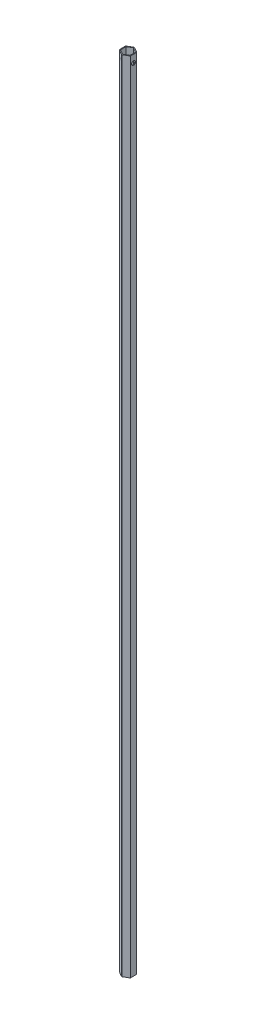
ISO-10303-21;
HEADER;
FILE_DESCRIPTION(('STEP AP214'),'2;1');
FILE_NAME('part.step','',(''),(''),'','','');
FILE_SCHEMA(('AUTOMOTIVE_DESIGN { 1 0 10303 214 1 1 1 1 }'));
ENDSEC;
DATA;
#1=APPLICATION_CONTEXT('core data for automotive mechanical design processes');
#2=APPLICATION_PROTOCOL_DEFINITION('international standard','automotive_design',2000,#1);
#3=PRODUCT_CONTEXT('',#1,'mechanical');
#4=PRODUCT('Part','Part','',(#3));
#5=PRODUCT_RELATED_PRODUCT_CATEGORY('part','',(#4));
#6=PRODUCT_DEFINITION_FORMATION('','',#4);
#7=PRODUCT_DEFINITION_CONTEXT('part definition',#1,'design');
#8=PRODUCT_DEFINITION('design','',#6,#7);
#9=PRODUCT_DEFINITION_SHAPE('','',#8);
#10=(LENGTH_UNIT() NAMED_UNIT(*) SI_UNIT(.MILLI.,.METRE.));
#11=(NAMED_UNIT(*) PLANE_ANGLE_UNIT() SI_UNIT($,.RADIAN.));
#12=(NAMED_UNIT(*) SI_UNIT($,.STERADIAN.) SOLID_ANGLE_UNIT());
#13=UNCERTAINTY_MEASURE_WITH_UNIT(LENGTH_MEASURE(1.E-05),#10,'distance_accuracy_value','');
#14=(GEOMETRIC_REPRESENTATION_CONTEXT(3) GLOBAL_UNCERTAINTY_ASSIGNED_CONTEXT((#13)) GLOBAL_UNIT_ASSIGNED_CONTEXT((#10,
#11,#12)) REPRESENTATION_CONTEXT('',''));
#15=CARTESIAN_POINT('',(0.,0.,0.));
#16=DIRECTION('',(0.,0.,1.));
#17=DIRECTION('',(1.,0.,0.));
#18=AXIS2_PLACEMENT_3D('',#15,#16,#17);
#19=CARTESIAN_POINT('',(9.1894241550849,1322.07,-5.34713867701928));
#20=DIRECTION('',(-0.497060999227279,0.,0.867715600324887));
#21=DIRECTION('',(0.867715600324887,0.,0.497060999227279));
#22=AXIS2_PLACEMENT_3D('',#19,#20,#21);
#23=PLANE('',#22);
#24=DIRECTION('',(0.867715600324887,0.,0.497060999227279));
#25=VECTOR('',#24,1.);
#26=CARTESIAN_POINT('',(9.1894241550849,238.76,-5.34713867701928));
#27=LINE('',#26,#25);
#28=CARTESIAN_POINT('',(0.600193456678505,238.76,-10.2673816597949));
#29=VERTEX_POINT('',#28);
#30=CARTESIAN_POINT('',(8.55318484409183,238.76,-5.71160112018785));
#31=VERTEX_POINT('',#30);
#32=EDGE_CURVE('E11',#29,#31,#27,.T.);
#33=ORIENTED_EDGE('',*,*,#32,.F.);
#34=DIRECTION('',(0.,-1.,0.));
#35=VECTOR('',#34,1.);
#36=CARTESIAN_POINT('',(0.600193456678505,1322.07,-10.2673816597949));
#37=LINE('',#36,#35);
#38=CARTESIAN_POINT('',(0.600193456678505,247.925435523385,-10.2673816597949));
#39=VERTEX_POINT('',#38);
#40=EDGE_CURVE('E192',#29,#39,#37,.F.);
#41=ORIENTED_EDGE('',*,*,#40,.T.);
#42=DIRECTION('',(-0.867715600324887,0.,-0.497060999227279));
#43=VECTOR('',#42,1.);
#44=CARTESIAN_POINT('',(9.1894241550849,247.925435523385,-5.34713867701928));
#45=LINE('',#44,#43);
#46=CARTESIAN_POINT('',(8.55318484409183,247.925435523385,-5.71160112018785));
#47=VERTEX_POINT('',#46);
#48=EDGE_CURVE('E52',#47,#39,#45,.T.);
#49=ORIENTED_EDGE('',*,*,#48,.F.);
#50=DIRECTION('',(0.,-1.,0.));
#51=VECTOR('',#50,1.);
#52=CARTESIAN_POINT('',(8.55318484409183,1322.07,-5.71160112018785));
#53=LINE('',#52,#51);
#54=EDGE_CURVE('E304',#47,#31,#53,.T.);
#55=ORIENTED_EDGE('',*,*,#54,.T.);
#56=EDGE_LOOP('',(#33,#41,#49,#55));
#57=FACE_BOUND('',#56,.T.);
#58=ADVANCED_FACE('F43',(#57),#23,.F.);
#59=CARTESIAN_POINT('',(0.600193456678505,-2.54,-10.2673816597949));
#60=VERTEX_POINT('',#59);
#61=EDGE_CURVE('E185',#60,#29,#37,.F.);
#62=ORIENTED_EDGE('',*,*,#61,.T.);
#63=ORIENTED_EDGE('',*,*,#32,.T.);
#64=CARTESIAN_POINT('',(8.55318484409183,-2.54,-5.71160112018785));
#65=VERTEX_POINT('',#64);
#66=EDGE_CURVE('E194',#31,#65,#53,.T.);
#67=ORIENTED_EDGE('',*,*,#66,.T.);
#68=DIRECTION('',(0.867715600324887,0.,0.497060999227279));
#69=VECTOR('',#68,1.);
#70=CARTESIAN_POINT('',(0.600193456678505,-2.54,-10.2673816597949));
#71=LINE('',#70,#69);
#72=EDGE_CURVE('E198',#60,#65,#71,.T.);
#73=ORIENTED_EDGE('',*,*,#72,.F.);
#74=EDGE_LOOP('',(#62,#63,#67,#73));
#75=FACE_BOUND('',#74,.T.);
#76=ADVANCED_FACE('F199',(#75),#23,.F.);
#77=CARTESIAN_POINT('',(-9.1894241550849,1322.07,5.34713867701928));
#78=DIRECTION('',(0.497060999227279,0.,-0.867715600324887));
#79=DIRECTION('',(-0.867715600324887,0.,-0.497060999227279));
#80=AXIS2_PLACEMENT_3D('',#77,#78,#79);
#81=PLANE('',#80);
#82=DIRECTION('',(0.867715600324887,0.,0.497060999227279));
#83=VECTOR('',#82,1.);
#84=CARTESIAN_POINT('',(-9.1894241550849,1312.90456447661,5.34713867701928));
#85=LINE('',#84,#83);
#86=CARTESIAN_POINT('',(-8.55318484409183,1312.90456447661,5.71160112018785));
#87=VERTEX_POINT('',#86);
#88=CARTESIAN_POINT('',(-0.600193456678505,1312.90456447661,10.2673816597949));
#89=VERTEX_POINT('',#88);
#90=EDGE_CURVE('E344',#87,#89,#85,.T.);
#91=ORIENTED_EDGE('',*,*,#90,.F.);
#92=DIRECTION('',(0.,-1.,0.));
#93=VECTOR('',#92,1.);
#94=CARTESIAN_POINT('',(-8.55318484409183,1322.07,5.71160112018785));
#95=LINE('',#94,#93);
#96=CARTESIAN_POINT('',(-8.55318484409183,-2.54,5.71160112018785));
#97=VERTEX_POINT('',#96);
#98=EDGE_CURVE('E328',#87,#97,#95,.T.);
#99=ORIENTED_EDGE('',*,*,#98,.T.);
#100=DIRECTION('',(-0.867715600324887,0.,-0.497060999227279));
#101=VECTOR('',#100,1.);
#102=CARTESIAN_POINT('',(-0.600193456678502,-2.54,10.2673816597949));
#103=LINE('',#102,#101);
#104=CARTESIAN_POINT('',(-0.600193456678502,-2.54,10.2673816597949));
#105=VERTEX_POINT('',#104);
#106=EDGE_CURVE('E228',#105,#97,#103,.T.);
#107=ORIENTED_EDGE('',*,*,#106,.F.);
#108=DIRECTION('',(0.,-1.,0.));
#109=VECTOR('',#108,1.);
#110=CARTESIAN_POINT('',(-0.600193456678505,1322.07,10.2673816597949));
#111=LINE('',#110,#109);
#112=EDGE_CURVE('E325',#105,#89,#111,.F.);
#113=ORIENTED_EDGE('',*,*,#112,.T.);
#114=EDGE_LOOP('',(#91,#99,#107,#113));
#115=FACE_BOUND('',#114,.T.);
#116=ADVANCED_FACE('F366',(#115),#81,.F.);
#117=CARTESIAN_POINT('',(0.,1322.07,0.));
#118=DIRECTION('',(0.,1.,0.));
#119=DIRECTION('',(0.,0.,1.));
#120=AXIS2_PLACEMENT_3D('',#117,#118,#119);
#121=PLANE('',#120);
#122=DIRECTION('',(-0.00339034760114294,0.,-0.999994252755056));
#123=VECTOR('',#122,1.);
#124=CARTESIAN_POINT('',(9.22547000939946,1322.07,5.28470542594423));
#125=LINE('',#124,#123);
#126=CARTESIAN_POINT('',(9.22547000939946,1322.07,5.28470542594423));
#127=VERTEX_POINT('',#126);
#128=CARTESIAN_POINT('',(9.19191007607211,1322.07,-4.6139080492287));
#129=VERTEX_POINT('',#128);
#130=EDGE_CURVE('E293',#127,#129,#125,.T.);
#131=ORIENTED_EDGE('',*,*,#130,.T.);
#132=CARTESIAN_POINT('',(7.92191737507319,1322.07,-4.60960230777524));
#133=DIRECTION('',(0.,1.,0.));
#134=DIRECTION('',(0.,0.,1.));
#135=AXIS2_PLACEMENT_3D('',#132,#133,#134);
#136=CIRCLE('',#135,1.27);
#137=CARTESIAN_POINT('',(8.55318484409183,1322.07,-5.71160112018785));
#138=VERTEX_POINT('',#137);
#139=EDGE_CURVE('E314',#129,#138,#136,.T.);
#140=ORIENTED_EDGE('',*,*,#139,.T.);
#141=DIRECTION('',(-0.867715600324887,0.,-0.497060999227279));
#142=VECTOR('',#141,1.);
#143=CARTESIAN_POINT('',(9.1894241550849,1322.07,-5.34713867701928));
#144=LINE('',#143,#142);
#145=CARTESIAN_POINT('',(0.600193456678505,1322.07,-10.2673816597949));
#146=VERTEX_POINT('',#145);
#147=EDGE_CURVE('E296',#138,#146,#144,.T.);
#148=ORIENTED_EDGE('',*,*,#147,.T.);
#149=CARTESIAN_POINT('',(-0.0310740123401385,1322.07,-9.16538284738234));
#150=DIRECTION('',(0.,1.,0.));
#151=DIRECTION('',(0.,0.,1.));
#152=AXIS2_PLACEMENT_3D('',#149,#150,#151);
#153=CIRCLE('',#152,1.27);
#154=CARTESIAN_POINT('',(-0.669799244320415,1322.07,-10.2630759183415));
#155=VERTEX_POINT('',#154);
#156=EDGE_CURVE('E312',#146,#155,#153,.T.);
#157=ORIENTED_EDGE('',*,*,#156,.T.);
#158=DIRECTION('',(-0.864325252723744,0.,0.502933253527778));
#159=VECTOR('',#158,1.);
#160=CARTESIAN_POINT('',(-0.0360458543145602,1322.07,-10.6318441029635));
#161=LINE('',#160,#159);
#162=CARTESIAN_POINT('',(-8.5917166193936,1322.07,-5.65347361056625));
#163=VERTEX_POINT('',#162);
#164=EDGE_CURVE('E282',#155,#163,#161,.T.);
#165=ORIENTED_EDGE('',*,*,#164,.T.);
#166=CARTESIAN_POINT('',(-7.95299138741333,1322.07,-4.55578053960709));
#167=DIRECTION('',(0.,1.,0.));
#168=DIRECTION('',(0.,0.,1.));
#169=AXIS2_PLACEMENT_3D('',#166,#167,#168);
#170=CIRCLE('',#169,1.27);
#171=CARTESIAN_POINT('',(-9.22298408841225,1322.07,-4.55147479815364));
#172=VERTEX_POINT('',#171);
#173=EDGE_CURVE('E310',#163,#172,#170,.T.);
#174=ORIENTED_EDGE('',*,*,#173,.T.);
#175=DIRECTION('',(0.0033903476011431,0.,0.999994252755056));
#176=VECTOR('',#175,1.);
#177=CARTESIAN_POINT('',(-9.22547000939946,1322.07,-5.28470542594423));
#178=LINE('',#177,#176);
#179=CARTESIAN_POINT('',(-9.19191007607211,1322.07,4.6139080492287));
#180=VERTEX_POINT('',#179);
#181=EDGE_CURVE('E285',#172,#180,#178,.T.);
#182=ORIENTED_EDGE('',*,*,#181,.T.);
#183=CARTESIAN_POINT('',(-7.92191737507319,1322.07,4.60960230777524));
#184=DIRECTION('',(0.,1.,0.));
#185=DIRECTION('',(0.,0.,1.));
#186=AXIS2_PLACEMENT_3D('',#183,#184,#185);
#187=CIRCLE('',#186,1.27);
#188=CARTESIAN_POINT('',(-8.55318484409183,1322.07,5.71160112018785));
#189=VERTEX_POINT('',#188);
#190=EDGE_CURVE('E308',#180,#189,#187,.T.);
#191=ORIENTED_EDGE('',*,*,#190,.T.);
#192=DIRECTION('',(0.867715600324887,0.,0.497060999227279));
#193=VECTOR('',#192,1.);
#194=CARTESIAN_POINT('',(-9.1894241550849,1322.07,5.34713867701928));
#195=LINE('',#194,#193);
#196=CARTESIAN_POINT('',(-0.600193456678501,1322.07,10.2673816597949));
#197=VERTEX_POINT('',#196);
#198=EDGE_CURVE('E288',#189,#197,#195,.T.);
#199=ORIENTED_EDGE('',*,*,#198,.T.);
#200=CARTESIAN_POINT('',(0.0310740123401411,1322.07,9.16538284738234));
#201=DIRECTION('',(0.,1.,0.));
#202=DIRECTION('',(0.,0.,1.));
#203=AXIS2_PLACEMENT_3D('',#200,#201,#202);
#204=CIRCLE('',#203,1.27);
#205=CARTESIAN_POINT('',(0.669799244320419,1322.07,10.2630759183415));
#206=VERTEX_POINT('',#205);
#207=EDGE_CURVE('E306',#197,#206,#204,.T.);
#208=ORIENTED_EDGE('',*,*,#207,.T.);
#209=DIRECTION('',(0.864325252723744,0.,-0.502933253527778));
#210=VECTOR('',#209,1.);
#211=CARTESIAN_POINT('',(0.0360458543145637,1322.07,10.6318441029635));
#212=LINE('',#211,#210);
#213=EDGE_CURVE('E291',#206,#127,#212,.T.);
#214=ORIENTED_EDGE('',*,*,#213,.T.);
#215=EDGE_LOOP('',(#131,#140,#148,#157,#165,#174,#182,#191,#199,#208,#214));
#216=FACE_BOUND('',#215,.T.);
#217=DIRECTION('',(0.0100189146559024,0.,0.999949809415011));
#218=VECTOR('',#217,1.);
#219=CARTESIAN_POINT('',(-7.98301547037814,1322.07,-4.50296261732613));
#220=LINE('',#219,#218);
#221=CARTESIAN_POINT('',(-7.98301547037814,1322.07,-4.50296261732613));
#222=VERTEX_POINT('',#221);
#223=CARTESIAN_POINT('',(-7.89118775408517,1322.07,4.66201288748859));
#224=VERTEX_POINT('',#223);
#225=EDGE_CURVE('E243',#222,#224,#220,.T.);
#226=ORIENTED_EDGE('',*,*,#225,.F.);
#227=DIRECTION('',(-0.860972480134856,0.,0.508651539317866));
#228=VECTOR('',#227,1.);
#229=CARTESIAN_POINT('',(-0.0918277162929726,1322.07,-9.16497550481472));
#230=LINE('',#229,#228);
#231=CARTESIAN_POINT('',(-0.0918277162929726,1322.07,-9.16497550481472));
#232=VERTEX_POINT('',#231);
#233=EDGE_CURVE('E241',#232,#222,#230,.T.);
#234=ORIENTED_EDGE('',*,*,#233,.F.);
#235=DIRECTION('',(-0.870991394790759,0.,-0.491298270097146));
#236=VECTOR('',#235,1.);
#237=CARTESIAN_POINT('',(7.89118775408517,1322.07,-4.66201288748859));
#238=LINE('',#237,#236);
#239=CARTESIAN_POINT('',(7.89118775408517,1322.07,-4.66201288748859));
#240=VERTEX_POINT('',#239);
#241=EDGE_CURVE('E253',#240,#232,#238,.T.);
#242=ORIENTED_EDGE('',*,*,#241,.F.);
#243=DIRECTION('',(-0.0100189146559026,0.,-0.999949809415011));
#244=VECTOR('',#243,1.);
#245=CARTESIAN_POINT('',(7.98301547037814,1322.07,4.50296261732613));
#246=LINE('',#245,#244);
#247=CARTESIAN_POINT('',(7.97566925307471,1322.07,3.76976457694095));
#248=VERTEX_POINT('',#247);
#249=EDGE_CURVE('E251',#248,#240,#246,.T.);
#250=ORIENTED_EDGE('',*,*,#249,.F.);
#251=CARTESIAN_POINT('',(6.70573299511764,1322.07,3.78248859855395));
#252=DIRECTION('',(0.,1.,0.));
#253=DIRECTION('',(0.,0.,1.));
#254=AXIS2_PLACEMENT_3D('',#251,#252,#253);
#255=CIRCLE('',#254,1.27);
#256=CARTESIAN_POINT('',(7.35172045005133,1322.07,4.87592364832522));
#257=VERTEX_POINT('',#256);
#258=EDGE_CURVE('E342',#248,#257,#255,.F.);
#259=ORIENTED_EDGE('',*,*,#258,.T.);
#260=DIRECTION('',(0.860972480134856,0.,-0.508651539317865));
#261=VECTOR('',#260,1.);
#262=CARTESIAN_POINT('',(0.0918277162929755,1322.07,9.16497550481472));
#263=LINE('',#262,#261);
#264=CARTESIAN_POINT('',(0.0918277162929755,1322.07,9.16497550481472));
#265=VERTEX_POINT('',#264);
#266=EDGE_CURVE('E248',#265,#257,#263,.T.);
#267=ORIENTED_EDGE('',*,*,#266,.F.);
#268=DIRECTION('',(0.870991394790759,0.,0.491298270097146));
#269=VECTOR('',#268,1.);
#270=CARTESIAN_POINT('',(-7.89118775408517,1322.07,4.66201288748859));
#271=LINE('',#270,#269);
#272=EDGE_CURVE('E246',#224,#265,#271,.T.);
#273=ORIENTED_EDGE('',*,*,#272,.F.);
#274=EDGE_LOOP('',(#226,#234,#242,#250,#259,#267,#273));
#275=FACE_BOUND('',#274,.T.);
#276=ADVANCED_FACE('F377',(#216,#275),#121,.T.);
#277=CARTESIAN_POINT('',(-0.0360458543145602,1322.07,-10.6318441029635));
#278=DIRECTION('',(0.502933253527778,0.,0.864325252723744));
#279=DIRECTION('',(0.864325252723744,0.,-0.502933253527778));
#280=AXIS2_PLACEMENT_3D('',#277,#278,#279);
#281=PLANE('',#280);
#282=ORIENTED_EDGE('',*,*,#164,.F.);
#283=DIRECTION('',(0.,-1.,0.));
#284=VECTOR('',#283,1.);
#285=CARTESIAN_POINT('',(-0.669799244320416,1322.07,-10.2630759183415));
#286=LINE('',#285,#284);
#287=CARTESIAN_POINT('',(-0.669799244320415,-2.54,-10.2630759183415));
#288=VERTEX_POINT('',#287);
#289=EDGE_CURVE('E318',#155,#288,#286,.T.);
#290=ORIENTED_EDGE('',*,*,#289,.T.);
#291=DIRECTION('',(0.864325252723744,0.,-0.502933253527778));
#292=VECTOR('',#291,1.);
#293=CARTESIAN_POINT('',(-8.5917166193936,-2.54,-5.65347361056625));
#294=LINE('',#293,#292);
#295=CARTESIAN_POINT('',(-8.5917166193936,-2.54,-5.65347361056625));
#296=VERTEX_POINT('',#295);
#297=EDGE_CURVE('E210',#296,#288,#294,.T.);
#298=ORIENTED_EDGE('',*,*,#297,.F.);
#299=DIRECTION('',(0.,-1.,0.));
#300=VECTOR('',#299,1.);
#301=CARTESIAN_POINT('',(-8.59171661939361,1322.07,-5.65347361056625));
#302=LINE('',#301,#300);
#303=EDGE_CURVE('E316',#296,#163,#302,.F.);
#304=ORIENTED_EDGE('',*,*,#303,.T.);
#305=EDGE_LOOP('',(#282,#290,#298,#304));
#306=FACE_BOUND('',#305,.T.);
#307=ADVANCED_FACE('F385',(#306),#281,.F.);
#308=CARTESIAN_POINT('',(-9.22547000939946,1322.07,-5.28470542594423));
#309=DIRECTION('',(0.999994252755056,0.,-0.0033903476011431));
#310=DIRECTION('',(-0.0033903476011431,0.,-0.999994252755056));
#311=AXIS2_PLACEMENT_3D('',#308,#309,#310);
#312=PLANE('',#311);
#313=CARTESIAN_POINT('',(-9.20733102812503,1309.37,0.065447171727209));
#314=DIRECTION('',(0.999994252755056,0.,-0.0033903476011431));
#315=DIRECTION('',(-0.0033903476011431,0.,-0.999994252755056));
#316=AXIS2_PLACEMENT_3D('',#313,#314,#315);
#317=CIRCLE('',#316,3.3782);
#318=CARTESIAN_POINT('',(-9.21878430039121,1309.37,-3.31273341292992));
#319=VERTEX_POINT('',#318);
#320=EDGE_CURVE('E630',#319,#319,#317,.T.);
#321=ORIENTED_EDGE('',*,*,#320,.T.);
#322=EDGE_LOOP('',(#321));
#323=FACE_BOUND('',#322,.T.);
#324=ORIENTED_EDGE('',*,*,#181,.F.);
#325=DIRECTION('',(0.,-1.,0.));
#326=VECTOR('',#325,1.);
#327=CARTESIAN_POINT('',(-9.22298408841225,1322.07,-4.55147479815364));
#328=LINE('',#327,#326);
#329=CARTESIAN_POINT('',(-9.22298408841225,-2.54,-4.55147479815364));
#330=VERTEX_POINT('',#329);
#331=EDGE_CURVE('E322',#172,#330,#328,.T.);
#332=ORIENTED_EDGE('',*,*,#331,.T.);
#333=DIRECTION('',(-0.00339034760114298,0.,-0.999994252755056));
#334=VECTOR('',#333,1.);
#335=CARTESIAN_POINT('',(-9.19191007607211,-2.54,4.6139080492287));
#336=LINE('',#335,#334);
#337=CARTESIAN_POINT('',(-9.19191007607211,-2.54,4.6139080492287));
#338=VERTEX_POINT('',#337);
#339=EDGE_CURVE('E234',#338,#330,#336,.T.);
#340=ORIENTED_EDGE('',*,*,#339,.F.);
#341=DIRECTION('',(0.,-1.,0.));
#342=VECTOR('',#341,1.);
#343=CARTESIAN_POINT('',(-9.19191007607211,1322.07,4.6139080492287));
#344=LINE('',#343,#342);
#345=EDGE_CURVE('E320',#338,#180,#344,.F.);
#346=ORIENTED_EDGE('',*,*,#345,.T.);
#347=EDGE_LOOP('',(#324,#332,#340,#346));
#348=FACE_BOUND('',#347,.T.);
#349=ADVANCED_FACE('F374',(#323,#348),#312,.F.);
#350=EDGE_CURVE('E329',#189,#87,#95,.T.);
#351=ORIENTED_EDGE('',*,*,#350,.T.);
#352=ORIENTED_EDGE('',*,*,#90,.T.);
#353=EDGE_CURVE('E324',#89,#197,#111,.F.);
#354=ORIENTED_EDGE('',*,*,#353,.T.);
#355=ORIENTED_EDGE('',*,*,#198,.F.);
#356=EDGE_LOOP('',(#351,#352,#354,#355));
#357=FACE_BOUND('',#356,.T.);
#358=ADVANCED_FACE('F355',(#357),#81,.F.);
#359=CARTESIAN_POINT('',(0.0360458543145637,1322.07,10.6318441029635));
#360=DIRECTION('',(-0.502933253527778,0.,-0.864325252723744));
#361=DIRECTION('',(-0.864325252723744,0.,0.502933253527778));
#362=AXIS2_PLACEMENT_3D('',#359,#360,#361);
#363=PLANE('',#362);
#364=ORIENTED_EDGE('',*,*,#213,.F.);
#365=DIRECTION('',(0.,-1.,0.));
#366=VECTOR('',#365,1.);
#367=CARTESIAN_POINT('',(0.669799244320419,1322.07,10.2630759183415));
#368=LINE('',#367,#366);
#369=CARTESIAN_POINT('',(0.669799244320419,-2.54,10.2630759183415));
#370=VERTEX_POINT('',#369);
#371=EDGE_CURVE('E332',#206,#370,#368,.T.);
#372=ORIENTED_EDGE('',*,*,#371,.T.);
#373=DIRECTION('',(-0.864325252723744,0.,0.502933253527778));
#374=VECTOR('',#373,1.);
#375=CARTESIAN_POINT('',(9.22547000939946,-2.54,5.28470542594423));
#376=LINE('',#375,#374);
#377=CARTESIAN_POINT('',(9.22547000939946,-2.54,5.28470542594423));
#378=VERTEX_POINT('',#377);
#379=EDGE_CURVE('E222',#378,#370,#376,.T.);
#380=ORIENTED_EDGE('',*,*,#379,.F.);
#381=DIRECTION('',(0.,-1.,0.));
#382=VECTOR('',#381,1.);
#383=CARTESIAN_POINT('',(9.22547000939946,1322.07,5.28470542594423));
#384=LINE('',#383,#382);
#385=EDGE_CURVE('E299',#127,#378,#384,.T.);
#386=ORIENTED_EDGE('',*,*,#385,.F.);
#387=EDGE_LOOP('',(#364,#372,#380,#386));
#388=FACE_BOUND('',#387,.T.);
#389=ADVANCED_FACE('F410',(#388),#363,.F.);
#390=CARTESIAN_POINT('',(9.22547000939946,1322.07,5.28470542594423));
#391=DIRECTION('',(-0.999994252755056,0.,0.00339034760114294));
#392=DIRECTION('',(0.00339034760114294,0.,0.999994252755056));
#393=AXIS2_PLACEMENT_3D('',#390,#391,#392);
#394=PLANE('',#393);
#395=CARTESIAN_POINT('',(9.20756313635934,1309.37,0.00301392065216177));
#396=DIRECTION('',(0.999994252755056,0.,-0.00339034760114294));
#397=DIRECTION('',(-0.00339034760114294,0.,-0.999994252755056));
#398=AXIS2_PLACEMENT_3D('',#395,#396,#397);
#399=CIRCLE('',#398,3.3782);
#400=CARTESIAN_POINT('',(9.19610986409316,1309.37,-3.37516666400497));
#401=VERTEX_POINT('',#400);
#402=EDGE_CURVE('E638',#401,#401,#399,.T.);
#403=ORIENTED_EDGE('',*,*,#402,.F.);
#404=EDGE_LOOP('',(#403));
#405=FACE_BOUND('',#404,.T.);
#406=ORIENTED_EDGE('',*,*,#385,.T.);
#407=DIRECTION('',(0.00339034760114287,0.,0.999994252755056));
#408=VECTOR('',#407,1.);
#409=CARTESIAN_POINT('',(9.19191007607211,-2.54,-4.6139080492287));
#410=LINE('',#409,#408);
#411=CARTESIAN_POINT('',(9.19191007607211,-2.54,-4.6139080492287));
#412=VERTEX_POINT('',#411);
#413=EDGE_CURVE('E219',#412,#378,#410,.T.);
#414=ORIENTED_EDGE('',*,*,#413,.F.);
#415=DIRECTION('',(0.,-1.,0.));
#416=VECTOR('',#415,1.);
#417=CARTESIAN_POINT('',(9.19191007607211,1322.07,-4.6139080492287));
#418=LINE('',#417,#416);
#419=EDGE_CURVE('E303',#412,#129,#418,.F.);
#420=ORIENTED_EDGE('',*,*,#419,.T.);
#421=ORIENTED_EDGE('',*,*,#130,.F.);
#422=EDGE_LOOP('',(#406,#414,#420,#421));
#423=FACE_BOUND('',#422,.T.);
#424=ADVANCED_FACE('F402',(#405,#423),#394,.F.);
#425=EDGE_CURVE('E301',#138,#47,#53,.T.);
#426=ORIENTED_EDGE('',*,*,#425,.T.);
#427=ORIENTED_EDGE('',*,*,#48,.T.);
#428=EDGE_CURVE('E196',#39,#146,#37,.F.);
#429=ORIENTED_EDGE('',*,*,#428,.T.);
#430=ORIENTED_EDGE('',*,*,#147,.F.);
#431=EDGE_LOOP('',(#426,#427,#429,#430));
#432=FACE_BOUND('',#431,.T.);
#433=ADVANCED_FACE('F389',(#432),#23,.F.);
#434=CARTESIAN_POINT('',(-0.0918277162929726,1322.07,-9.16497550481472));
#435=DIRECTION('',(0.508651539317866,0.,0.860972480134856));
#436=DIRECTION('',(0.860972480134856,0.,-0.508651539317866));
#437=AXIS2_PLACEMENT_3D('',#434,#435,#436);
#438=PLANE('',#437);
#439=DIRECTION('',(-0.860972480134856,0.,0.508651539317866));
#440=VECTOR('',#439,1.);
#441=CARTESIAN_POINT('',(-0.0918277162929726,0.,-9.16497550481472));
#442=LINE('',#441,#440);
#443=CARTESIAN_POINT('',(-0.0918277162929725,0.,-9.16497550481472));
#444=VERTEX_POINT('',#443);
#445=CARTESIAN_POINT('',(-7.98301547037814,0.,-4.50296261732613));
#446=VERTEX_POINT('',#445);
#447=EDGE_CURVE('E240',#444,#446,#442,.T.);
#448=ORIENTED_EDGE('',*,*,#447,.F.);
#449=DIRECTION('',(0.,-1.,0.));
#450=VECTOR('',#449,1.);
#451=CARTESIAN_POINT('',(-0.0918277162929726,1322.07,-9.16497550481472));
#452=LINE('',#451,#450);
#453=EDGE_CURVE('E255',#232,#444,#452,.T.);
#454=ORIENTED_EDGE('',*,*,#453,.F.);
#455=ORIENTED_EDGE('',*,*,#233,.T.);
#456=DIRECTION('',(0.,-1.,0.));
#457=VECTOR('',#456,1.);
#458=CARTESIAN_POINT('',(-7.98301547037814,1322.07,-4.50296261732613));
#459=LINE('',#458,#457);
#460=EDGE_CURVE('E279',#222,#446,#459,.T.);
#461=ORIENTED_EDGE('',*,*,#460,.T.);
#462=EDGE_LOOP('',(#448,#454,#455,#461));
#463=FACE_BOUND('',#462,.T.);
#464=ADVANCED_FACE('F401',(#463),#438,.T.);
#465=CARTESIAN_POINT('',(-7.98301547037814,1322.07,-4.50296261732613));
#466=DIRECTION('',(0.999949809415011,0.,-0.0100189146559024));
#467=DIRECTION('',(-0.0100189146559024,0.,-0.999949809415011));
#468=AXIS2_PLACEMENT_3D('',#465,#466,#467);
#469=PLANE('',#468);
#470=CARTESIAN_POINT('',(-7.93728580803003,1309.37,0.0611412522147427));
#471=DIRECTION('',(0.999949809415011,0.,-0.0100189146559024));
#472=DIRECTION('',(0.0100189146559024,0.,0.999949809415011));
#473=AXIS2_PLACEMENT_3D('',#470,#471,#472);
#474=ELLIPSE('',#473,3.37827422047586,3.3782);
#475=CARTESIAN_POINT('',(-7.90343916693085,1309.37,3.43924591513123));
#476=VERTEX_POINT('',#475);
#477=EDGE_CURVE('E627',#476,#476,#474,.T.);
#478=ORIENTED_EDGE('',*,*,#477,.F.);
#479=EDGE_LOOP('',(#478));
#480=FACE_BOUND('',#479,.T.);
#481=DIRECTION('',(0.0100189146559024,0.,0.999949809415011));
#482=VECTOR('',#481,1.);
#483=CARTESIAN_POINT('',(-7.98301547037814,0.,-4.50296261732613));
#484=LINE('',#483,#482);
#485=CARTESIAN_POINT('',(-7.89118775408517,0.,4.66201288748859));
#486=VERTEX_POINT('',#485);
#487=EDGE_CURVE('E258',#446,#486,#484,.T.);
#488=ORIENTED_EDGE('',*,*,#487,.F.);
#489=ORIENTED_EDGE('',*,*,#460,.F.);
#490=ORIENTED_EDGE('',*,*,#225,.T.);
#491=DIRECTION('',(0.,-1.,0.));
#492=VECTOR('',#491,1.);
#493=CARTESIAN_POINT('',(-7.89118775408517,1322.07,4.66201288748859));
#494=LINE('',#493,#492);
#495=EDGE_CURVE('E277',#224,#486,#494,.T.);
#496=ORIENTED_EDGE('',*,*,#495,.T.);
#497=EDGE_LOOP('',(#488,#489,#490,#496));
#498=FACE_BOUND('',#497,.T.);
#499=ADVANCED_FACE('F407',(#480,#498),#469,.T.);
#500=CARTESIAN_POINT('',(-7.89118775408517,1322.07,4.66201288748859));
#501=DIRECTION('',(0.491298270097146,0.,-0.870991394790759));
#502=DIRECTION('',(-0.870991394790759,0.,-0.491298270097146));
#503=AXIS2_PLACEMENT_3D('',#500,#501,#502);
#504=PLANE('',#503);
#505=DIRECTION('',(0.870991394790759,0.,0.491298270097146));
#506=VECTOR('',#505,1.);
#507=CARTESIAN_POINT('',(-7.89118775408517,0.,4.66201288748859));
#508=LINE('',#507,#506);
#509=CARTESIAN_POINT('',(0.0918277162929755,0.,9.16497550481472));
#510=VERTEX_POINT('',#509);
#511=EDGE_CURVE('E261',#486,#510,#508,.T.);
#512=ORIENTED_EDGE('',*,*,#511,.F.);
#513=ORIENTED_EDGE('',*,*,#495,.F.);
#514=ORIENTED_EDGE('',*,*,#272,.T.);
#515=DIRECTION('',(0.,-1.,0.));
#516=VECTOR('',#515,1.);
#517=CARTESIAN_POINT('',(0.0918277162929755,1322.07,9.16497550481472));
#518=LINE('',#517,#516);
#519=EDGE_CURVE('E275',#265,#510,#518,.T.);
#520=ORIENTED_EDGE('',*,*,#519,.T.);
#521=EDGE_LOOP('',(#512,#513,#514,#520));
#522=FACE_BOUND('',#521,.T.);
#523=ADVANCED_FACE('F460',(#522),#504,.T.);
#524=CARTESIAN_POINT('',(0.0918277162929755,1322.07,9.16497550481472));
#525=DIRECTION('',(-0.508651539317866,0.,-0.860972480134857));
#526=DIRECTION('',(-0.860972480134857,0.,0.508651539317866));
#527=AXIS2_PLACEMENT_3D('',#524,#525,#526);
#528=PLANE('',#527);
#529=ORIENTED_EDGE('',*,*,#266,.T.);
#530=DIRECTION('',(0.,-1.,0.));
#531=VECTOR('',#530,1.);
#532=CARTESIAN_POINT('',(7.35172045005133,0.,4.87592364832522));
#533=LINE('',#532,#531);
#534=CARTESIAN_POINT('',(7.35172045005133,0.,4.87592364832522));
#535=VERTEX_POINT('',#534);
#536=EDGE_CURVE('E334',#257,#535,#533,.T.);
#537=ORIENTED_EDGE('',*,*,#536,.T.);
#538=DIRECTION('',(0.860972480134856,0.,-0.508651539317865));
#539=VECTOR('',#538,1.);
#540=CARTESIAN_POINT('',(0.0918277162929755,0.,9.16497550481472));
#541=LINE('',#540,#539);
#542=EDGE_CURVE('E264',#510,#535,#541,.T.);
#543=ORIENTED_EDGE('',*,*,#542,.F.);
#544=ORIENTED_EDGE('',*,*,#519,.F.);
#545=EDGE_LOOP('',(#529,#537,#543,#544));
#546=FACE_BOUND('',#545,.T.);
#547=ADVANCED_FACE('F456',(#546),#528,.T.);
#548=CARTESIAN_POINT('',(7.98301547037814,1322.07,4.50296261732613));
#549=DIRECTION('',(-0.999949809415011,0.,0.0100189146559026));
#550=DIRECTION('',(0.0100189146559026,0.,0.999949809415011));
#551=AXIS2_PLACEMENT_3D('',#548,#549,#550);
#552=PLANE('',#551);
#553=CARTESIAN_POINT('',(7.93797173288365,1309.37,0.00731830155969868));
#554=DIRECTION('',(-0.999949809415011,0.,0.0100189146559026));
#555=DIRECTION('',(0.0100189146559026,0.,0.999949809415012));
#556=AXIS2_PLACEMENT_3D('',#553,#554,#555);
#557=ELLIPSE('',#556,3.37827422047586,3.3782);
#558=CARTESIAN_POINT('',(7.97181837398283,1309.37,3.38542296447618));
#559=VERTEX_POINT('',#558);
#560=EDGE_CURVE('E631',#559,#559,#557,.T.);
#561=ORIENTED_EDGE('',*,*,#560,.F.);
#562=EDGE_LOOP('',(#561));
#563=FACE_BOUND('',#562,.T.);
#564=DIRECTION('',(-0.0100189146559026,0.,-0.999949809415011));
#565=VECTOR('',#564,1.);
#566=CARTESIAN_POINT('',(7.98301547037814,0.,4.50296261732613));
#567=LINE('',#566,#565);
#568=CARTESIAN_POINT('',(7.97566925307471,0.,3.76976457694095));
#569=VERTEX_POINT('',#568);
#570=CARTESIAN_POINT('',(7.89118775408517,0.,-4.66201288748859));
#571=VERTEX_POINT('',#570);
#572=EDGE_CURVE('E267',#569,#571,#567,.T.);
#573=ORIENTED_EDGE('',*,*,#572,.F.);
#574=DIRECTION('',(0.,-1.,0.));
#575=VECTOR('',#574,1.);
#576=CARTESIAN_POINT('',(7.97566925307471,1322.07,3.76976457694095));
#577=LINE('',#576,#575);
#578=EDGE_CURVE('E337',#569,#248,#577,.F.);
#579=ORIENTED_EDGE('',*,*,#578,.T.);
#580=ORIENTED_EDGE('',*,*,#249,.T.);
#581=DIRECTION('',(0.,-1.,0.));
#582=VECTOR('',#581,1.);
#583=CARTESIAN_POINT('',(7.89118775408517,1322.07,-4.66201288748859));
#584=LINE('',#583,#582);
#585=EDGE_CURVE('E273',#240,#571,#584,.T.);
#586=ORIENTED_EDGE('',*,*,#585,.T.);
#587=EDGE_LOOP('',(#573,#579,#580,#586));
#588=FACE_BOUND('',#587,.T.);
#589=ADVANCED_FACE('F472',(#563,#588),#552,.T.);
#590=CARTESIAN_POINT('',(7.89118775408517,1322.07,-4.66201288748859));
#591=DIRECTION('',(-0.491298270097146,0.,0.870991394790759));
#592=DIRECTION('',(0.870991394790759,0.,0.491298270097146));
#593=AXIS2_PLACEMENT_3D('',#590,#591,#592);
#594=PLANE('',#593);
#595=DIRECTION('',(-0.870991394790759,0.,-0.491298270097146));
#596=VECTOR('',#595,1.);
#597=CARTESIAN_POINT('',(7.89118775408517,0.,-4.66201288748859));
#598=LINE('',#597,#596);
#599=EDGE_CURVE('E244',#571,#444,#598,.T.);
#600=ORIENTED_EDGE('',*,*,#599,.F.);
#601=ORIENTED_EDGE('',*,*,#585,.F.);
#602=ORIENTED_EDGE('',*,*,#241,.T.);
#603=ORIENTED_EDGE('',*,*,#453,.T.);
#604=EDGE_LOOP('',(#600,#601,#602,#603));
#605=FACE_BOUND('',#604,.T.);
#606=ADVANCED_FACE('F429',(#605),#594,.T.);
#607=CARTESIAN_POINT('',(7.92191737507319,1322.07,-4.60960230777524));
#608=DIRECTION('',(0.,-1.,0.));
#609=DIRECTION('',(0.,0.,-1.));
#610=AXIS2_PLACEMENT_3D('',#607,#608,#609);
#611=CYLINDRICAL_SURFACE('',#610,1.27);
#612=ORIENTED_EDGE('',*,*,#139,.F.);
#613=ORIENTED_EDGE('',*,*,#419,.F.);
#614=CARTESIAN_POINT('',(7.92191737507319,-2.54,-4.60960230777524));
#615=DIRECTION('',(0.,-1.,0.));
#616=DIRECTION('',(0.,0.,-1.));
#617=AXIS2_PLACEMENT_3D('',#614,#615,#616);
#618=CIRCLE('',#617,1.27);
#619=EDGE_CURVE('E204',#65,#412,#618,.T.);
#620=ORIENTED_EDGE('',*,*,#619,.F.);
#621=ORIENTED_EDGE('',*,*,#66,.F.);
#622=ORIENTED_EDGE('',*,*,#54,.F.);
#623=ORIENTED_EDGE('',*,*,#425,.F.);
#624=EDGE_LOOP('',(#612,#613,#620,#621,#622,#623));
#625=FACE_BOUND('',#624,.T.);
#626=ADVANCED_FACE('F392',(#625),#611,.T.);
#627=CARTESIAN_POINT('',(-0.0310740123401385,1322.07,-9.16538284738234));
#628=DIRECTION('',(0.,-1.,0.));
#629=DIRECTION('',(0.,0.,-1.));
#630=AXIS2_PLACEMENT_3D('',#627,#628,#629);
#631=CYLINDRICAL_SURFACE('',#630,1.27);
#632=ORIENTED_EDGE('',*,*,#156,.F.);
#633=ORIENTED_EDGE('',*,*,#428,.F.);
#634=ORIENTED_EDGE('',*,*,#40,.F.);
#635=ORIENTED_EDGE('',*,*,#61,.F.);
#636=CARTESIAN_POINT('',(-0.0310740123401385,-2.54,-9.16538284738234));
#637=DIRECTION('',(0.,-1.,0.));
#638=DIRECTION('',(0.,0.,-1.));
#639=AXIS2_PLACEMENT_3D('',#636,#637,#638);
#640=CIRCLE('',#639,1.27);
#641=EDGE_CURVE('E191',#288,#60,#640,.T.);
#642=ORIENTED_EDGE('',*,*,#641,.F.);
#643=ORIENTED_EDGE('',*,*,#289,.F.);
#644=EDGE_LOOP('',(#632,#633,#634,#635,#642,#643));
#645=FACE_BOUND('',#644,.T.);
#646=ADVANCED_FACE('F188',(#645),#631,.T.);
#647=CARTESIAN_POINT('',(-7.95299138741333,1322.07,-4.55578053960709));
#648=DIRECTION('',(0.,-1.,0.));
#649=DIRECTION('',(0.,0.,-1.));
#650=AXIS2_PLACEMENT_3D('',#647,#648,#649);
#651=CYLINDRICAL_SURFACE('',#650,1.27);
#652=ORIENTED_EDGE('',*,*,#173,.F.);
#653=ORIENTED_EDGE('',*,*,#303,.F.);
#654=CARTESIAN_POINT('',(-7.95299138741333,-2.54,-4.55578053960709));
#655=DIRECTION('',(0.,-1.,0.));
#656=DIRECTION('',(0.,0.,-1.));
#657=AXIS2_PLACEMENT_3D('',#654,#655,#656);
#658=CIRCLE('',#657,1.27);
#659=EDGE_CURVE('E237',#330,#296,#658,.T.);
#660=ORIENTED_EDGE('',*,*,#659,.F.);
#661=ORIENTED_EDGE('',*,*,#331,.F.);
#662=EDGE_LOOP('',(#652,#653,#660,#661));
#663=FACE_BOUND('',#662,.T.);
#664=ADVANCED_FACE('F382',(#663),#651,.T.);
#665=CARTESIAN_POINT('',(-7.92191737507319,1322.07,4.60960230777524));
#666=DIRECTION('',(0.,-1.,0.));
#667=DIRECTION('',(0.,0.,-1.));
#668=AXIS2_PLACEMENT_3D('',#665,#666,#667);
#669=CYLINDRICAL_SURFACE('',#668,1.27);
#670=ORIENTED_EDGE('',*,*,#190,.F.);
#671=ORIENTED_EDGE('',*,*,#345,.F.);
#672=CARTESIAN_POINT('',(-7.92191737507319,-2.54,4.60960230777524));
#673=DIRECTION('',(0.,-1.,0.));
#674=DIRECTION('',(0.,0.,-1.));
#675=AXIS2_PLACEMENT_3D('',#672,#673,#674);
#676=CIRCLE('',#675,1.27);
#677=EDGE_CURVE('E231',#97,#338,#676,.T.);
#678=ORIENTED_EDGE('',*,*,#677,.F.);
#679=ORIENTED_EDGE('',*,*,#98,.F.);
#680=ORIENTED_EDGE('',*,*,#350,.F.);
#681=EDGE_LOOP('',(#670,#671,#678,#679,#680));
#682=FACE_BOUND('',#681,.T.);
#683=ADVANCED_FACE('F371',(#682),#669,.T.);
#684=CARTESIAN_POINT('',(0.0310740123401411,1322.07,9.16538284738234));
#685=DIRECTION('',(0.,-1.,0.));
#686=DIRECTION('',(0.,0.,-1.));
#687=AXIS2_PLACEMENT_3D('',#684,#685,#686);
#688=CYLINDRICAL_SURFACE('',#687,1.27);
#689=ORIENTED_EDGE('',*,*,#207,.F.);
#690=ORIENTED_EDGE('',*,*,#353,.F.);
#691=ORIENTED_EDGE('',*,*,#112,.F.);
#692=CARTESIAN_POINT('',(0.0310740123401411,-2.54,9.16538284738234));
#693=DIRECTION('',(0.,-1.,0.));
#694=DIRECTION('',(0.,0.,-1.));
#695=AXIS2_PLACEMENT_3D('',#692,#693,#694);
#696=CIRCLE('',#695,1.27);
#697=EDGE_CURVE('E225',#370,#105,#696,.T.);
#698=ORIENTED_EDGE('',*,*,#697,.F.);
#699=ORIENTED_EDGE('',*,*,#371,.F.);
#700=EDGE_LOOP('',(#689,#690,#691,#698,#699));
#701=FACE_BOUND('',#700,.T.);
#702=ADVANCED_FACE('F362',(#701),#688,.T.);
#703=CARTESIAN_POINT('',(6.70573299511764,1322.07,3.78248859855395));
#704=DIRECTION('',(0.,1.,0.));
#705=DIRECTION('',(0.,0.,1.));
#706=AXIS2_PLACEMENT_3D('',#703,#704,#705);
#707=CYLINDRICAL_SURFACE('',#706,1.27);
#708=ORIENTED_EDGE('',*,*,#258,.F.);
#709=ORIENTED_EDGE('',*,*,#578,.F.);
#710=CARTESIAN_POINT('',(6.70573299511764,0.,3.78248859855395));
#711=DIRECTION('',(0.,1.,0.));
#712=DIRECTION('',(0.,0.,1.));
#713=AXIS2_PLACEMENT_3D('',#710,#711,#712);
#714=CIRCLE('',#713,1.27);
#715=EDGE_CURVE('E339',#535,#569,#714,.T.);
#716=ORIENTED_EDGE('',*,*,#715,.F.);
#717=ORIENTED_EDGE('',*,*,#536,.F.);
#718=EDGE_LOOP('',(#708,#709,#716,#717));
#719=FACE_BOUND('',#718,.T.);
#720=ADVANCED_FACE('F45',(#719),#707,.F.);
#721=CARTESIAN_POINT('',(-0.0310740123401385,0.,-9.16538284738234));
#722=DIRECTION('',(0.,-1.,0.));
#723=DIRECTION('',(0.,0.,-1.));
#724=AXIS2_PLACEMENT_3D('',#721,#722,#723);
#725=PLANE('',#724);
#726=CARTESIAN_POINT('',(0.,0.,0.));
#727=DIRECTION('',(0.,-1.,0.));
#728=DIRECTION('',(0.,0.,-1.));
#729=AXIS2_PLACEMENT_3D('',#726,#727,#728);
#730=CIRCLE('',#729,3.17499999999983);
#731=CARTESIAN_POINT('',(0.,0.,-3.17499999999983));
#732=VERTEX_POINT('',#731);
#733=EDGE_CURVE('E211',#732,#732,#730,.T.);
#734=ORIENTED_EDGE('',*,*,#733,.T.);
#735=EDGE_LOOP('',(#734));
#736=FACE_BOUND('',#735,.T.);
#737=ORIENTED_EDGE('',*,*,#599,.T.);
#738=ORIENTED_EDGE('',*,*,#447,.T.);
#739=ORIENTED_EDGE('',*,*,#487,.T.);
#740=ORIENTED_EDGE('',*,*,#511,.T.);
#741=ORIENTED_EDGE('',*,*,#542,.T.);
#742=ORIENTED_EDGE('',*,*,#715,.T.);
#743=ORIENTED_EDGE('',*,*,#572,.T.);
#744=EDGE_LOOP('',(#737,#738,#739,#740,#741,#742,#743));
#745=FACE_BOUND('',#744,.T.);
#746=ADVANCED_FACE('F439',(#736,#745),#725,.F.);
#747=CARTESIAN_POINT('',(-0.0310740123401385,-2.54,-9.16538284738234));
#748=DIRECTION('',(0.,-1.,0.));
#749=DIRECTION('',(0.,0.,-1.));
#750=AXIS2_PLACEMENT_3D('',#747,#748,#749);
#751=PLANE('',#750);
#752=CARTESIAN_POINT('',(0.,-2.54,0.));
#753=DIRECTION('',(0.,-1.,0.));
#754=DIRECTION('',(0.,0.,-1.));
#755=AXIS2_PLACEMENT_3D('',#752,#753,#754);
#756=CIRCLE('',#755,3.17499999999999);
#757=CARTESIAN_POINT('',(0.,-2.54,-3.17499999999999));
#758=VERTEX_POINT('',#757);
#759=EDGE_CURVE('E214',#758,#758,#756,.T.);
#760=ORIENTED_EDGE('',*,*,#759,.F.);
#761=EDGE_LOOP('',(#760));
#762=FACE_BOUND('',#761,.T.);
#763=ORIENTED_EDGE('',*,*,#641,.T.);
#764=ORIENTED_EDGE('',*,*,#72,.T.);
#765=ORIENTED_EDGE('',*,*,#619,.T.);
#766=ORIENTED_EDGE('',*,*,#413,.T.);
#767=ORIENTED_EDGE('',*,*,#379,.T.);
#768=ORIENTED_EDGE('',*,*,#697,.T.);
#769=ORIENTED_EDGE('',*,*,#106,.T.);
#770=ORIENTED_EDGE('',*,*,#677,.T.);
#771=ORIENTED_EDGE('',*,*,#339,.T.);
#772=ORIENTED_EDGE('',*,*,#659,.T.);
#773=ORIENTED_EDGE('',*,*,#297,.T.);
#774=EDGE_LOOP('',(#763,#764,#765,#766,#767,#768,#769,#770,#771,#772,#773));
#775=FACE_BOUND('',#774,.T.);
#776=ADVANCED_FACE('F207',(#762,#775),#751,.T.);
#777=CARTESIAN_POINT('',(0.,-2.54,0.));
#778=DIRECTION('',(0.,-1.,0.));
#779=DIRECTION('',(0.,0.,-1.));
#780=AXIS2_PLACEMENT_3D('',#777,#778,#779);
#781=CYLINDRICAL_SURFACE('',#780,3.17499999999983);
#782=ORIENTED_EDGE('',*,*,#759,.T.);
#783=EDGE_LOOP('',(#782));
#784=FACE_BOUND('',#783,.T.);
#785=ORIENTED_EDGE('',*,*,#733,.F.);
#786=EDGE_LOOP('',(#785));
#787=FACE_BOUND('',#786,.T.);
#788=ADVANCED_FACE('F560',(#784,#787),#781,.F.);
#789=CARTESIAN_POINT('',(9.20756313635934,1309.37,0.00301392065216177));
#790=DIRECTION('',(0.999994252755056,0.,-0.00339034760114294));
#791=DIRECTION('',(-0.00339034760114294,0.,-0.999994252755056));
#792=AXIS2_PLACEMENT_3D('',#789,#790,#791);
#793=CYLINDRICAL_SURFACE('',#792,3.3782);
#794=ORIENTED_EDGE('',*,*,#560,.T.);
#795=EDGE_LOOP('',(#794));
#796=FACE_BOUND('',#795,.T.);
#797=ORIENTED_EDGE('',*,*,#402,.T.);
#798=EDGE_LOOP('',(#797));
#799=FACE_BOUND('',#798,.T.);
#800=ADVANCED_FACE('F571',(#796,#799),#793,.F.);
#801=ORIENTED_EDGE('',*,*,#477,.T.);
#802=EDGE_LOOP('',(#801));
#803=FACE_BOUND('',#802,.T.);
#804=ORIENTED_EDGE('',*,*,#320,.F.);
#805=EDGE_LOOP('',(#804));
#806=FACE_BOUND('',#805,.T.);
#807=ADVANCED_FACE('F606',(#803,#806),#793,.F.);
#808=CLOSED_SHELL('',(#58,#76,#116,#276,#307,#349,#358,#389,#424,#433,#464,#499,#523,#547,#589,
#606,#626,#646,#664,#683,#702,#720,#746,#776,#788,#800,#807));
#809=MANIFOLD_SOLID_BREP('B2',#808);
#810=ADVANCED_BREP_SHAPE_REPRESENTATION('',(#18,#809),#14);
#811=SHAPE_DEFINITION_REPRESENTATION(#9,#810);
ENDSEC;
END-ISO-10303-21;
